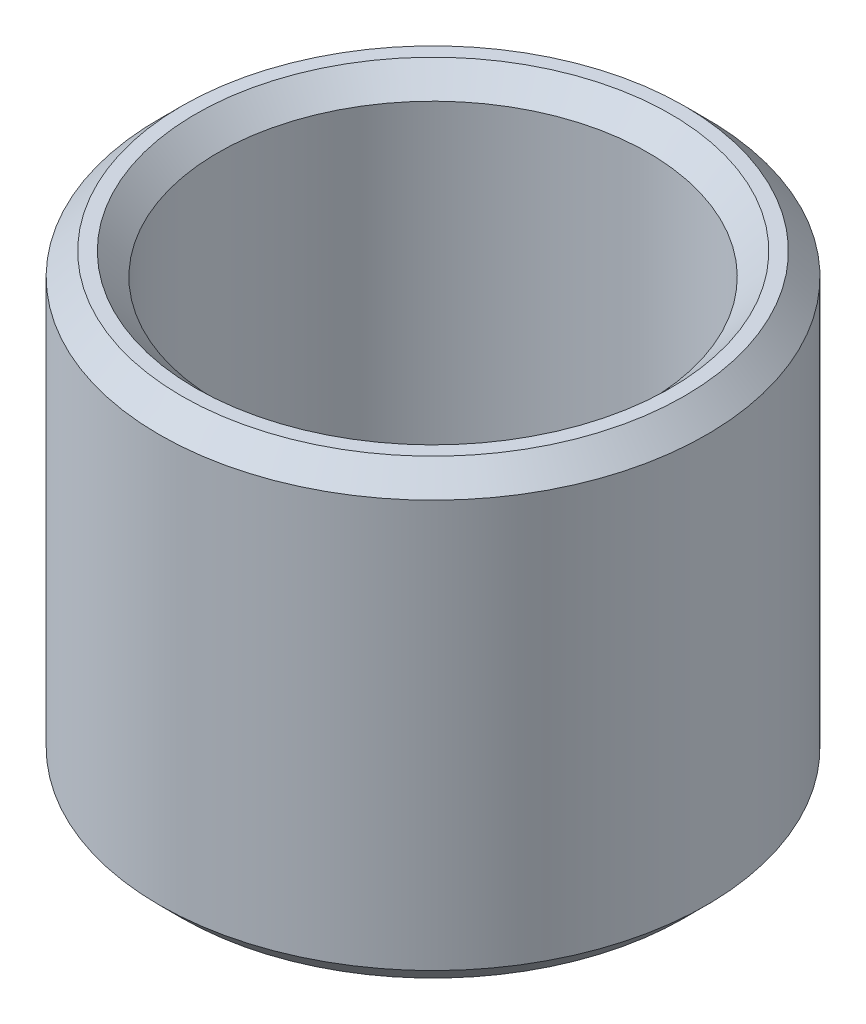
ISO-10303-21;
HEADER;
FILE_DESCRIPTION(('STEP AP214'),'2;1');
FILE_NAME('part.step','',(''),(''),'','','');
FILE_SCHEMA(('AUTOMOTIVE_DESIGN { 1 0 10303 214 1 1 1 1 }'));
ENDSEC;
DATA;
#1=APPLICATION_CONTEXT('core data for automotive mechanical design processes');
#2=APPLICATION_PROTOCOL_DEFINITION('international standard','automotive_design',2000,#1);
#3=PRODUCT_CONTEXT('',#1,'mechanical');
#4=PRODUCT('Part','Part','',(#3));
#5=PRODUCT_RELATED_PRODUCT_CATEGORY('part','',(#4));
#6=PRODUCT_DEFINITION_FORMATION('','',#4);
#7=PRODUCT_DEFINITION_CONTEXT('part definition',#1,'design');
#8=PRODUCT_DEFINITION('design','',#6,#7);
#9=PRODUCT_DEFINITION_SHAPE('','',#8);
#10=(LENGTH_UNIT() NAMED_UNIT(*) SI_UNIT(.MILLI.,.METRE.));
#11=(NAMED_UNIT(*) PLANE_ANGLE_UNIT() SI_UNIT($,.RADIAN.));
#12=(NAMED_UNIT(*) SI_UNIT($,.STERADIAN.) SOLID_ANGLE_UNIT());
#13=UNCERTAINTY_MEASURE_WITH_UNIT(LENGTH_MEASURE(1.E-05),#10,'distance_accuracy_value','');
#14=(GEOMETRIC_REPRESENTATION_CONTEXT(3) GLOBAL_UNCERTAINTY_ASSIGNED_CONTEXT((#13)) GLOBAL_UNIT_ASSIGNED_CONTEXT((#10,
#11,#12)) REPRESENTATION_CONTEXT('',''));
#15=CARTESIAN_POINT('',(0.,0.,0.));
#16=DIRECTION('',(0.,0.,1.));
#17=DIRECTION('',(1.,0.,0.));
#18=AXIS2_PLACEMENT_3D('',#15,#16,#17);
#19=CARTESIAN_POINT('',(0.,66.0765331328698,0.));
#20=DIRECTION('',(0.,-1.,0.));
#21=DIRECTION('',(0.,0.,-1.));
#22=AXIS2_PLACEMENT_3D('',#19,#20,#21);
#23=CYLINDRICAL_SURFACE('',#22,40.);
#24=CARTESIAN_POINT('',(0.,3.26191028515058,0.));
#25=DIRECTION('',(0.,1.,0.));
#26=DIRECTION('',(0.,0.,1.));
#27=AXIS2_PLACEMENT_3D('',#24,#25,#26);
#28=CIRCLE('',#27,40.);
#29=CARTESIAN_POINT('',(0.,3.26191028515058,40.));
#30=VERTEX_POINT('',#29);
#31=EDGE_CURVE('E10',#30,#30,#28,.T.);
#32=ORIENTED_EDGE('',*,*,#31,.T.);
#33=EDGE_LOOP('',(#32));
#34=FACE_BOUND('',#33,.T.);
#35=CARTESIAN_POINT('',(0.,62.8146228477192,0.));
#36=DIRECTION('',(0.,1.,0.));
#37=DIRECTION('',(0.,0.,1.));
#38=AXIS2_PLACEMENT_3D('',#35,#36,#37);
#39=CIRCLE('',#38,40.);
#40=CARTESIAN_POINT('',(0.,62.8146228477192,40.));
#41=VERTEX_POINT('',#40);
#42=EDGE_CURVE('E50',#41,#41,#39,.F.);
#43=ORIENTED_EDGE('',*,*,#42,.T.);
#44=EDGE_LOOP('',(#43));
#45=FACE_BOUND('',#44,.T.);
#46=ADVANCED_FACE('F39',(#34,#45),#23,.T.);
#47=CARTESIAN_POINT('',(0.,66.0765331328698,0.));
#48=DIRECTION('',(0.,1.,0.));
#49=DIRECTION('',(0.,0.,1.));
#50=AXIS2_PLACEMENT_3D('',#47,#48,#49);
#51=PLANE('',#50);
#52=CARTESIAN_POINT('',(0.,66.0765331328698,0.));
#53=DIRECTION('',(0.,1.,0.));
#54=DIRECTION('',(0.,0.,1.));
#55=AXIS2_PLACEMENT_3D('',#52,#53,#54);
#56=CIRCLE('',#55,34.7094838458572);
#57=CARTESIAN_POINT('',(0.,66.0765331328698,34.7094838458572));
#58=VERTEX_POINT('',#57);
#59=EDGE_CURVE('E58',#58,#58,#56,.F.);
#60=ORIENTED_EDGE('',*,*,#59,.T.);
#61=EDGE_LOOP('',(#60));
#62=FACE_BOUND('',#61,.T.);
#63=CARTESIAN_POINT('',(0.,66.0765331328698,0.));
#64=DIRECTION('',(0.,1.,0.));
#65=DIRECTION('',(0.,0.,1.));
#66=AXIS2_PLACEMENT_3D('',#63,#64,#65);
#67=CIRCLE('',#66,36.7380897148494);
#68=CARTESIAN_POINT('',(0.,66.0765331328698,36.7380897148494));
#69=VERTEX_POINT('',#68);
#70=EDGE_CURVE('E61',#69,#69,#67,.T.);
#71=ORIENTED_EDGE('',*,*,#70,.T.);
#72=EDGE_LOOP('',(#71));
#73=FACE_BOUND('',#72,.T.);
#74=ADVANCED_FACE('F88',(#62,#73),#51,.T.);
#75=CARTESIAN_POINT('',(0.,0.,0.));
#76=DIRECTION('',(0.,1.,0.));
#77=DIRECTION('',(0.,0.,1.));
#78=AXIS2_PLACEMENT_3D('',#75,#76,#77);
#79=PLANE('',#78);
#80=CARTESIAN_POINT('',(0.,0.,0.));
#81=DIRECTION('',(0.,1.,0.));
#82=DIRECTION('',(0.,0.,1.));
#83=AXIS2_PLACEMENT_3D('',#80,#81,#82);
#84=CIRCLE('',#83,34.7094838458572);
#85=CARTESIAN_POINT('',(0.,0.,34.7094838458572));
#86=VERTEX_POINT('',#85);
#87=EDGE_CURVE('E51',#86,#86,#84,.T.);
#88=ORIENTED_EDGE('',*,*,#87,.T.);
#89=EDGE_LOOP('',(#88));
#90=FACE_BOUND('',#89,.T.);
#91=CARTESIAN_POINT('',(0.,0.,0.));
#92=DIRECTION('',(0.,1.,0.));
#93=DIRECTION('',(0.,0.,1.));
#94=AXIS2_PLACEMENT_3D('',#91,#92,#93);
#95=CIRCLE('',#94,36.7380897148494);
#96=CARTESIAN_POINT('',(0.,0.,36.7380897148494));
#97=VERTEX_POINT('',#96);
#98=EDGE_CURVE('E54',#97,#97,#95,.F.);
#99=ORIENTED_EDGE('',*,*,#98,.T.);
#100=EDGE_LOOP('',(#99));
#101=FACE_BOUND('',#100,.T.);
#102=ADVANCED_FACE('F83',(#90,#101),#79,.F.);
#103=CARTESIAN_POINT('',(0.,66.0765331328698,0.));
#104=DIRECTION('',(0.,-1.,0.));
#105=DIRECTION('',(0.,0.,-1.));
#106=AXIS2_PLACEMENT_3D('',#103,#104,#105);
#107=CYLINDRICAL_SURFACE('',#106,31.4475735607066);
#108=CARTESIAN_POINT('',(0.,62.8146228477193,0.));
#109=DIRECTION('',(0.,1.,0.));
#110=DIRECTION('',(0.,0.,1.));
#111=AXIS2_PLACEMENT_3D('',#108,#109,#110);
#112=CIRCLE('',#111,31.4475735607066);
#113=CARTESIAN_POINT('',(0.,62.8146228477193,31.4475735607066));
#114=VERTEX_POINT('',#113);
#115=EDGE_CURVE('E67',#114,#114,#112,.T.);
#116=ORIENTED_EDGE('',*,*,#115,.T.);
#117=EDGE_LOOP('',(#116));
#118=FACE_BOUND('',#117,.T.);
#119=CARTESIAN_POINT('',(0.,3.26191028515059,0.));
#120=DIRECTION('',(0.,1.,0.));
#121=DIRECTION('',(0.,0.,1.));
#122=AXIS2_PLACEMENT_3D('',#119,#120,#121);
#123=CIRCLE('',#122,31.4475735607066);
#124=CARTESIAN_POINT('',(0.,3.26191028515059,31.4475735607066));
#125=VERTEX_POINT('',#124);
#126=EDGE_CURVE('E69',#125,#125,#123,.F.);
#127=ORIENTED_EDGE('',*,*,#126,.T.);
#128=EDGE_LOOP('',(#127));
#129=FACE_BOUND('',#128,.T.);
#130=ADVANCED_FACE('F71',(#118,#129),#107,.F.);
#131=CARTESIAN_POINT('',(0.,62.8146228477193,0.));
#132=DIRECTION('',(0.,1.,0.));
#133=DIRECTION('',(0.,0.,1.));
#134=AXIS2_PLACEMENT_3D('',#131,#132,#133);
#135=CONICAL_SURFACE('',#134,31.4475735607066,0.785398163397456);
#136=ORIENTED_EDGE('',*,*,#59,.F.);
#137=EDGE_LOOP('',(#136));
#138=FACE_BOUND('',#137,.T.);
#139=ORIENTED_EDGE('',*,*,#115,.F.);
#140=EDGE_LOOP('',(#139));
#141=FACE_BOUND('',#140,.T.);
#142=ADVANCED_FACE('F77',(#138,#141),#135,.F.);
#143=CARTESIAN_POINT('',(0.,0.,0.));
#144=DIRECTION('',(0.,-1.,0.));
#145=DIRECTION('',(0.,0.,-1.));
#146=AXIS2_PLACEMENT_3D('',#143,#144,#145);
#147=CONICAL_SURFACE('',#146,34.7094838458572,0.785398163397443);
#148=ORIENTED_EDGE('',*,*,#126,.F.);
#149=EDGE_LOOP('',(#148));
#150=FACE_BOUND('',#149,.T.);
#151=ORIENTED_EDGE('',*,*,#87,.F.);
#152=EDGE_LOOP('',(#151));
#153=FACE_BOUND('',#152,.T.);
#154=ADVANCED_FACE('F73',(#150,#153),#147,.F.);
#155=CARTESIAN_POINT('',(0.,3.26191028515058,0.));
#156=DIRECTION('',(0.,1.,0.));
#157=DIRECTION('',(0.,0.,1.));
#158=AXIS2_PLACEMENT_3D('',#155,#156,#157);
#159=CONICAL_SURFACE('',#158,40.,0.785398163397451);
#160=ORIENTED_EDGE('',*,*,#98,.F.);
#161=EDGE_LOOP('',(#160));
#162=FACE_BOUND('',#161,.T.);
#163=ORIENTED_EDGE('',*,*,#31,.F.);
#164=EDGE_LOOP('',(#163));
#165=FACE_BOUND('',#164,.T.);
#166=ADVANCED_FACE('F76',(#162,#165),#159,.T.);
#167=CARTESIAN_POINT('',(0.,66.0765331328698,0.));
#168=DIRECTION('',(0.,-1.,0.));
#169=DIRECTION('',(0.,0.,-1.));
#170=AXIS2_PLACEMENT_3D('',#167,#168,#169);
#171=CONICAL_SURFACE('',#170,36.7380897148494,0.785398163397445);
#172=ORIENTED_EDGE('',*,*,#42,.F.);
#173=EDGE_LOOP('',(#172));
#174=FACE_BOUND('',#173,.T.);
#175=ORIENTED_EDGE('',*,*,#70,.F.);
#176=EDGE_LOOP('',(#175));
#177=FACE_BOUND('',#176,.T.);
#178=ADVANCED_FACE('F45',(#174,#177),#171,.T.);
#179=CLOSED_SHELL('',(#46,#74,#102,#130,#142,#154,#166,#178));
#180=MANIFOLD_SOLID_BREP('B2',#179);
#181=ADVANCED_BREP_SHAPE_REPRESENTATION('',(#18,#180),#14);
#182=SHAPE_DEFINITION_REPRESENTATION(#9,#181);
ENDSEC;
END-ISO-10303-21;
